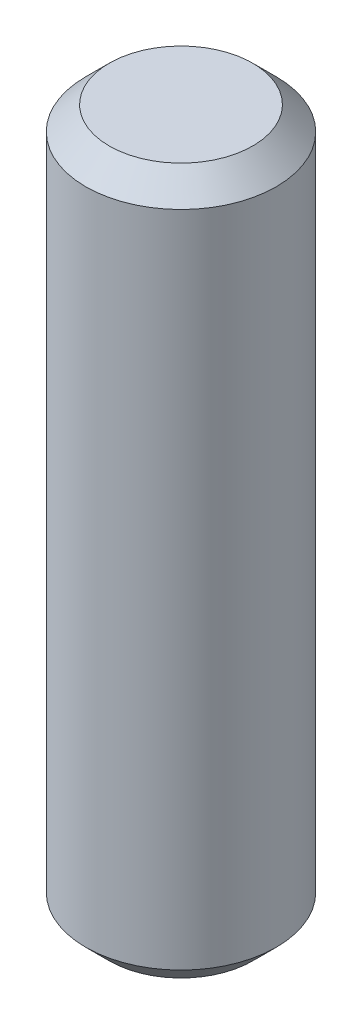
ISO-10303-21;
HEADER;
FILE_DESCRIPTION(('STEP AP214'),'2;1');
FILE_NAME('part.step','',(''),(''),'','','');
FILE_SCHEMA(('AUTOMOTIVE_DESIGN { 1 0 10303 214 1 1 1 1 }'));
ENDSEC;
DATA;
#1=APPLICATION_CONTEXT('core data for automotive mechanical design processes');
#2=APPLICATION_PROTOCOL_DEFINITION('international standard','automotive_design',2000,#1);
#3=PRODUCT_CONTEXT('',#1,'mechanical');
#4=PRODUCT('Part','Part','',(#3));
#5=PRODUCT_RELATED_PRODUCT_CATEGORY('part','',(#4));
#6=PRODUCT_DEFINITION_FORMATION('','',#4);
#7=PRODUCT_DEFINITION_CONTEXT('part definition',#1,'design');
#8=PRODUCT_DEFINITION('design','',#6,#7);
#9=PRODUCT_DEFINITION_SHAPE('','',#8);
#10=(LENGTH_UNIT() NAMED_UNIT(*) SI_UNIT(.MILLI.,.METRE.));
#11=(NAMED_UNIT(*) PLANE_ANGLE_UNIT() SI_UNIT($,.RADIAN.));
#12=(NAMED_UNIT(*) SI_UNIT($,.STERADIAN.) SOLID_ANGLE_UNIT());
#13=UNCERTAINTY_MEASURE_WITH_UNIT(LENGTH_MEASURE(1.E-05),#10,'distance_accuracy_value','');
#14=(GEOMETRIC_REPRESENTATION_CONTEXT(3) GLOBAL_UNCERTAINTY_ASSIGNED_CONTEXT((#13)) GLOBAL_UNIT_ASSIGNED_CONTEXT((#10,
#11,#12)) REPRESENTATION_CONTEXT('',''));
#15=CARTESIAN_POINT('',(0.,0.,0.));
#16=DIRECTION('',(0.,0.,1.));
#17=DIRECTION('',(1.,0.,0.));
#18=AXIS2_PLACEMENT_3D('',#15,#16,#17);
#19=CARTESIAN_POINT('',(0.,15.,0.));
#20=DIRECTION('',(0.,-1.,0.));
#21=DIRECTION('',(0.,0.,-1.));
#22=AXIS2_PLACEMENT_3D('',#19,#20,#21);
#23=CYLINDRICAL_SURFACE('',#22,4.05);
#24=CARTESIAN_POINT('',(0.,-14.,0.));
#25=DIRECTION('',(0.,1.,0.));
#26=DIRECTION('',(0.,0.,1.));
#27=AXIS2_PLACEMENT_3D('',#24,#25,#26);
#28=CIRCLE('',#27,4.05);
#29=CARTESIAN_POINT('',(0.,-14.,4.05));
#30=VERTEX_POINT('',#29);
#31=EDGE_CURVE('E45',#30,#30,#28,.T.);
#32=ORIENTED_EDGE('',*,*,#31,.T.);
#33=EDGE_LOOP('',(#32));
#34=FACE_BOUND('',#33,.T.);
#35=CARTESIAN_POINT('',(0.,14.,0.));
#36=DIRECTION('',(0.,1.,0.));
#37=DIRECTION('',(0.,0.,1.));
#38=AXIS2_PLACEMENT_3D('',#35,#36,#37);
#39=CIRCLE('',#38,4.05);
#40=CARTESIAN_POINT('',(0.,14.,4.05));
#41=VERTEX_POINT('',#40);
#42=EDGE_CURVE('E49',#41,#41,#39,.F.);
#43=ORIENTED_EDGE('',*,*,#42,.T.);
#44=EDGE_LOOP('',(#43));
#45=FACE_BOUND('',#44,.T.);
#46=ADVANCED_FACE('F33',(#34,#45),#23,.T.);
#47=CARTESIAN_POINT('',(0.,15.,0.));
#48=DIRECTION('',(0.,1.,0.));
#49=DIRECTION('',(0.,0.,1.));
#50=AXIS2_PLACEMENT_3D('',#47,#48,#49);
#51=PLANE('',#50);
#52=CARTESIAN_POINT('',(0.,15.,0.));
#53=DIRECTION('',(0.,1.,0.));
#54=DIRECTION('',(0.,0.,1.));
#55=AXIS2_PLACEMENT_3D('',#52,#53,#54);
#56=CIRCLE('',#55,3.05);
#57=CARTESIAN_POINT('',(0.,15.,3.05));
#58=VERTEX_POINT('',#57);
#59=EDGE_CURVE('E10',#58,#58,#56,.T.);
#60=ORIENTED_EDGE('',*,*,#59,.T.);
#61=EDGE_LOOP('',(#60));
#62=FACE_BOUND('',#61,.T.);
#63=ADVANCED_FACE('F65',(#62),#51,.T.);
#64=CARTESIAN_POINT('',(0.,-15.,0.));
#65=DIRECTION('',(0.,1.,0.));
#66=DIRECTION('',(0.,0.,1.));
#67=AXIS2_PLACEMENT_3D('',#64,#65,#66);
#68=PLANE('',#67);
#69=CARTESIAN_POINT('',(0.,-15.,0.));
#70=DIRECTION('',(0.,1.,0.));
#71=DIRECTION('',(0.,0.,1.));
#72=AXIS2_PLACEMENT_3D('',#69,#70,#71);
#73=CIRCLE('',#72,3.05);
#74=CARTESIAN_POINT('',(0.,-15.,3.05));
#75=VERTEX_POINT('',#74);
#76=EDGE_CURVE('E41',#75,#75,#73,.F.);
#77=ORIENTED_EDGE('',*,*,#76,.T.);
#78=EDGE_LOOP('',(#77));
#79=FACE_BOUND('',#78,.T.);
#80=ADVANCED_FACE('F62',(#79),#68,.F.);
#81=CARTESIAN_POINT('',(0.,-14.,0.));
#82=DIRECTION('',(0.,1.,0.));
#83=DIRECTION('',(0.,0.,1.));
#84=AXIS2_PLACEMENT_3D('',#81,#82,#83);
#85=CONICAL_SURFACE('',#84,4.05,0.785398163397447);
#86=ORIENTED_EDGE('',*,*,#76,.F.);
#87=EDGE_LOOP('',(#86));
#88=FACE_BOUND('',#87,.T.);
#89=ORIENTED_EDGE('',*,*,#31,.F.);
#90=EDGE_LOOP('',(#89));
#91=FACE_BOUND('',#90,.T.);
#92=ADVANCED_FACE('F58',(#88,#91),#85,.T.);
#93=CARTESIAN_POINT('',(0.,15.,0.));
#94=DIRECTION('',(0.,-1.,0.));
#95=DIRECTION('',(0.,0.,-1.));
#96=AXIS2_PLACEMENT_3D('',#93,#94,#95);
#97=CONICAL_SURFACE('',#96,3.05,0.785398163397448);
#98=ORIENTED_EDGE('',*,*,#42,.F.);
#99=EDGE_LOOP('',(#98));
#100=FACE_BOUND('',#99,.T.);
#101=ORIENTED_EDGE('',*,*,#59,.F.);
#102=EDGE_LOOP('',(#101));
#103=FACE_BOUND('',#102,.T.);
#104=ADVANCED_FACE('F36',(#100,#103),#97,.T.);
#105=CLOSED_SHELL('',(#46,#63,#80,#92,#104));
#106=MANIFOLD_SOLID_BREP('B2',#105);
#107=ADVANCED_BREP_SHAPE_REPRESENTATION('',(#18,#106),#14);
#108=SHAPE_DEFINITION_REPRESENTATION(#9,#107);
ENDSEC;
END-ISO-10303-21;
